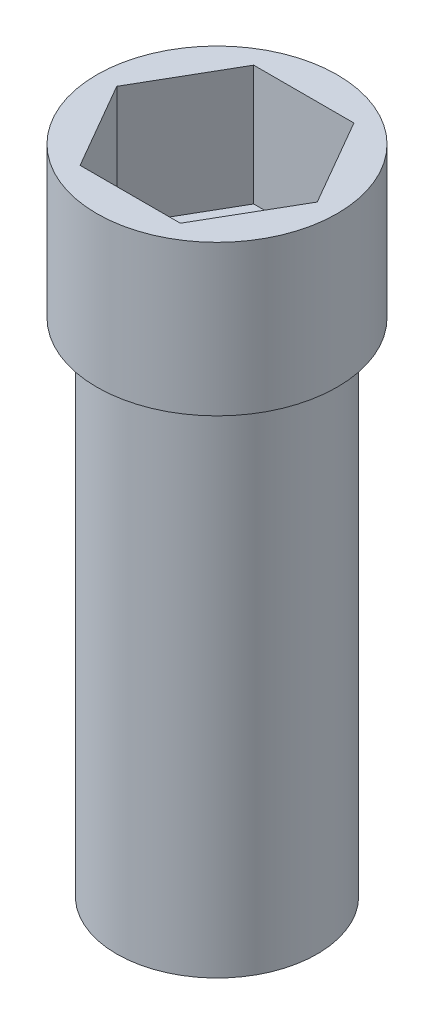
ISO-10303-21;
HEADER;
FILE_DESCRIPTION(('STEP AP214'),'2;1');
FILE_NAME('part.step','',(''),(''),'','','');
FILE_SCHEMA(('AUTOMOTIVE_DESIGN { 1 0 10303 214 1 1 1 1 }'));
ENDSEC;
DATA;
#1=APPLICATION_CONTEXT('core data for automotive mechanical design processes');
#2=APPLICATION_PROTOCOL_DEFINITION('international standard','automotive_design',2000,#1);
#3=PRODUCT_CONTEXT('',#1,'mechanical');
#4=PRODUCT('Part','Part','',(#3));
#5=PRODUCT_RELATED_PRODUCT_CATEGORY('part','',(#4));
#6=PRODUCT_DEFINITION_FORMATION('','',#4);
#7=PRODUCT_DEFINITION_CONTEXT('part definition',#1,'design');
#8=PRODUCT_DEFINITION('design','',#6,#7);
#9=PRODUCT_DEFINITION_SHAPE('','',#8);
#10=(LENGTH_UNIT() NAMED_UNIT(*) SI_UNIT(.MILLI.,.METRE.));
#11=(NAMED_UNIT(*) PLANE_ANGLE_UNIT() SI_UNIT($,.RADIAN.));
#12=(NAMED_UNIT(*) SI_UNIT($,.STERADIAN.) SOLID_ANGLE_UNIT());
#13=UNCERTAINTY_MEASURE_WITH_UNIT(LENGTH_MEASURE(1.E-05),#10,'distance_accuracy_value','');
#14=(GEOMETRIC_REPRESENTATION_CONTEXT(3) GLOBAL_UNCERTAINTY_ASSIGNED_CONTEXT((#13)) GLOBAL_UNIT_ASSIGNED_CONTEXT((#10,
#11,#12)) REPRESENTATION_CONTEXT('',''));
#15=CARTESIAN_POINT('',(0.,0.,0.));
#16=DIRECTION('',(0.,0.,1.));
#17=DIRECTION('',(1.,0.,0.));
#18=AXIS2_PLACEMENT_3D('',#15,#16,#17);
#19=CARTESIAN_POINT('',(0.,-1270.,0.));
#20=DIRECTION('',(0.,1.,0.));
#21=DIRECTION('',(0.,0.,1.));
#22=AXIS2_PLACEMENT_3D('',#19,#20,#21);
#23=CYLINDRICAL_SURFACE('',#22,254.);
#24=CARTESIAN_POINT('',(0.,-1270.,0.));
#25=DIRECTION('',(0.,1.,0.));
#26=DIRECTION('',(0.,0.,1.));
#27=AXIS2_PLACEMENT_3D('',#24,#25,#26);
#28=CIRCLE('',#27,254.);
#29=CARTESIAN_POINT('',(0.,-1270.,254.));
#30=VERTEX_POINT('',#29);
#31=EDGE_CURVE('E191',#30,#30,#28,.T.);
#32=ORIENTED_EDGE('',*,*,#31,.T.);
#33=EDGE_LOOP('',(#32));
#34=FACE_BOUND('',#33,.T.);
#35=CARTESIAN_POINT('',(0.,0.,0.));
#36=DIRECTION('',(0.,1.,0.));
#37=DIRECTION('',(0.,0.,1.));
#38=AXIS2_PLACEMENT_3D('',#35,#36,#37);
#39=CIRCLE('',#38,254.);
#40=CARTESIAN_POINT('',(0.,0.,254.));
#41=VERTEX_POINT('',#40);
#42=EDGE_CURVE('E188',#41,#41,#39,.T.);
#43=ORIENTED_EDGE('',*,*,#42,.F.);
#44=EDGE_LOOP('',(#43));
#45=FACE_BOUND('',#44,.T.);
#46=CARTESIAN_POINT('',(0.,-190.5,0.));
#47=DIRECTION('',(0.,-1.,0.));
#48=DIRECTION('',(0.,0.,-1.));
#49=AXIS2_PLACEMENT_3D('',#46,#47,#48);
#50=CIRCLE('',#49,254.);
#51=CARTESIAN_POINT('',(76.1999999999998,-190.5,-242.300557159905));
#52=VERTEX_POINT('',#51);
#53=CARTESIAN_POINT('',(-76.2,-190.5,-242.300557159918));
#54=VERTEX_POINT('',#53);
#55=EDGE_CURVE('E131',#52,#54,#50,.F.);
#56=ORIENTED_EDGE('',*,*,#55,.T.);
#57=DIRECTION('',(0.,1.,0.));
#58=VECTOR('',#57,1.);
#59=CARTESIAN_POINT('',(-76.1999999999998,-1269.99999999999,-242.300557159918));
#60=LINE('',#59,#58);
#61=CARTESIAN_POINT('',(-76.2,-825.499999999993,-242.300557159918));
#62=VERTEX_POINT('',#61);
#63=EDGE_CURVE('E11',#54,#62,#60,.F.);
#64=ORIENTED_EDGE('',*,*,#63,.T.);
#65=CARTESIAN_POINT('',(0.,-825.5,0.));
#66=DIRECTION('',(0.,1.,0.));
#67=DIRECTION('',(0.,0.,1.));
#68=AXIS2_PLACEMENT_3D('',#65,#66,#67);
#69=CIRCLE('',#68,254.);
#70=CARTESIAN_POINT('',(76.2,-825.5,-242.300557159904));
#71=VERTEX_POINT('',#70);
#72=EDGE_CURVE('E194',#62,#71,#69,.F.);
#73=ORIENTED_EDGE('',*,*,#72,.T.);
#74=DIRECTION('',(0.,1.,0.));
#75=VECTOR('',#74,1.);
#76=CARTESIAN_POINT('',(76.2,-1270.,-242.300557159904));
#77=LINE('',#76,#75);
#78=EDGE_CURVE('E44',#71,#52,#77,.T.);
#79=ORIENTED_EDGE('',*,*,#78,.T.);
#80=EDGE_LOOP('',(#56,#64,#73,#79));
#81=FACE_BOUND('',#80,.T.);
#82=ADVANCED_FACE('F37',(#34,#45,#81),#23,.T.);
#83=CARTESIAN_POINT('',(0.,-1270.,0.));
#84=DIRECTION('',(0.,1.,0.));
#85=DIRECTION('',(0.,0.,1.));
#86=AXIS2_PLACEMENT_3D('',#83,#84,#85);
#87=PLANE('',#86);
#88=ORIENTED_EDGE('',*,*,#31,.F.);
#89=EDGE_LOOP('',(#88));
#90=FACE_BOUND('',#89,.T.);
#91=ADVANCED_FACE('F219',(#90),#87,.F.);
#92=CARTESIAN_POINT('',(0.,381.,0.));
#93=DIRECTION('',(0.,-1.,0.));
#94=DIRECTION('',(0.,0.,-1.));
#95=AXIS2_PLACEMENT_3D('',#92,#93,#94);
#96=CYLINDRICAL_SURFACE('',#95,304.8);
#97=CARTESIAN_POINT('',(0.,381.,0.));
#98=DIRECTION('',(0.,1.,0.));
#99=DIRECTION('',(0.,0.,1.));
#100=AXIS2_PLACEMENT_3D('',#97,#98,#99);
#101=CIRCLE('',#100,304.8);
#102=CARTESIAN_POINT('',(0.,381.,304.8));
#103=VERTEX_POINT('',#102);
#104=EDGE_CURVE('E185',#103,#103,#101,.T.);
#105=ORIENTED_EDGE('',*,*,#104,.F.);
#106=EDGE_LOOP('',(#105));
#107=FACE_BOUND('',#106,.T.);
#108=CARTESIAN_POINT('',(0.,0.,0.));
#109=DIRECTION('',(0.,1.,0.));
#110=DIRECTION('',(0.,0.,1.));
#111=AXIS2_PLACEMENT_3D('',#108,#109,#110);
#112=CIRCLE('',#111,304.8);
#113=CARTESIAN_POINT('',(0.,0.,304.8));
#114=VERTEX_POINT('',#113);
#115=EDGE_CURVE('E175',#114,#114,#112,.T.);
#116=ORIENTED_EDGE('',*,*,#115,.T.);
#117=EDGE_LOOP('',(#116));
#118=FACE_BOUND('',#117,.T.);
#119=ADVANCED_FACE('F224',(#107,#118),#96,.T.);
#120=CARTESIAN_POINT('',(0.,381.,0.));
#121=DIRECTION('',(0.,1.,0.));
#122=DIRECTION('',(0.,0.,1.));
#123=AXIS2_PLACEMENT_3D('',#120,#121,#122);
#124=PLANE('',#123);
#125=DIRECTION('',(-0.500000000000001,0.,0.866025403784438));
#126=VECTOR('',#125,1.);
#127=CARTESIAN_POINT('',(-254.070753313979,381.,0.));
#128=LINE('',#127,#126);
#129=CARTESIAN_POINT('',(-127.035376656989,381.,-220.031726728555));
#130=VERTEX_POINT('',#129);
#131=CARTESIAN_POINT('',(-254.070753313979,381.,0.));
#132=VERTEX_POINT('',#131);
#133=EDGE_CURVE('E59',#130,#132,#128,.T.);
#134=ORIENTED_EDGE('',*,*,#133,.F.);
#135=DIRECTION('',(-1.,0.,0.));
#136=VECTOR('',#135,1.);
#137=CARTESIAN_POINT('',(-127.035376656989,381.,-220.031726728555));
#138=LINE('',#137,#136);
#139=CARTESIAN_POINT('',(127.03537665699,381.,-220.031726728555));
#140=VERTEX_POINT('',#139);
#141=EDGE_CURVE('E144',#140,#130,#138,.T.);
#142=ORIENTED_EDGE('',*,*,#141,.F.);
#143=DIRECTION('',(-0.500000000000001,0.,-0.866025403784438));
#144=VECTOR('',#143,1.);
#145=CARTESIAN_POINT('',(127.03537665699,381.,-220.031726728555));
#146=LINE('',#145,#144);
#147=CARTESIAN_POINT('',(254.07075331398,381.,0.));
#148=VERTEX_POINT('',#147);
#149=EDGE_CURVE('E168',#148,#140,#146,.T.);
#150=ORIENTED_EDGE('',*,*,#149,.F.);
#151=DIRECTION('',(0.500000000000001,0.,-0.866025403784438));
#152=VECTOR('',#151,1.);
#153=CARTESIAN_POINT('',(254.07075331398,381.,0.));
#154=LINE('',#153,#152);
#155=CARTESIAN_POINT('',(127.03537665699,381.,220.031726728555));
#156=VERTEX_POINT('',#155);
#157=EDGE_CURVE('E165',#156,#148,#154,.T.);
#158=ORIENTED_EDGE('',*,*,#157,.F.);
#159=DIRECTION('',(1.,0.,0.));
#160=VECTOR('',#159,1.);
#161=CARTESIAN_POINT('',(127.03537665699,381.,220.031726728555));
#162=LINE('',#161,#160);
#163=CARTESIAN_POINT('',(-127.035376656989,381.,220.031726728555));
#164=VERTEX_POINT('',#163);
#165=EDGE_CURVE('E162',#164,#156,#162,.T.);
#166=ORIENTED_EDGE('',*,*,#165,.F.);
#167=DIRECTION('',(0.500000000000001,0.,0.866025403784438));
#168=VECTOR('',#167,1.);
#169=CARTESIAN_POINT('',(-127.035376656989,381.,220.031726728555));
#170=LINE('',#169,#168);
#171=EDGE_CURVE('E134',#132,#164,#170,.T.);
#172=ORIENTED_EDGE('',*,*,#171,.F.);
#173=EDGE_LOOP('',(#134,#142,#150,#158,#166,#172));
#174=FACE_BOUND('',#173,.T.);
#175=ORIENTED_EDGE('',*,*,#104,.T.);
#176=EDGE_LOOP('',(#175));
#177=FACE_BOUND('',#176,.T.);
#178=ADVANCED_FACE('F234',(#174,#177),#124,.T.);
#179=CARTESIAN_POINT('',(0.,0.,0.));
#180=DIRECTION('',(0.,1.,0.));
#181=DIRECTION('',(0.,0.,1.));
#182=AXIS2_PLACEMENT_3D('',#179,#180,#181);
#183=PLANE('',#182);
#184=ORIENTED_EDGE('',*,*,#42,.T.);
#185=EDGE_LOOP('',(#184));
#186=FACE_BOUND('',#185,.T.);
#187=ORIENTED_EDGE('',*,*,#115,.F.);
#188=EDGE_LOOP('',(#187));
#189=FACE_BOUND('',#188,.T.);
#190=ADVANCED_FACE('F230',(#186,#189),#183,.F.);
#191=CARTESIAN_POINT('',(-254.070753313979,76.2,0.));
#192=DIRECTION('',(-0.866025403784438,0.,-0.500000000000001));
#193=DIRECTION('',(-0.500000000000001,0.,0.866025403784438));
#194=AXIS2_PLACEMENT_3D('',#191,#192,#193);
#195=PLANE('',#194);
#196=ORIENTED_EDGE('',*,*,#133,.T.);
#197=DIRECTION('',(0.,1.,0.));
#198=VECTOR('',#197,1.);
#199=CARTESIAN_POINT('',(-254.070753313979,76.2,0.));
#200=LINE('',#199,#198);
#201=CARTESIAN_POINT('',(-254.070753313979,76.2,0.));
#202=VERTEX_POINT('',#201);
#203=EDGE_CURVE('E158',#202,#132,#200,.T.);
#204=ORIENTED_EDGE('',*,*,#203,.F.);
#205=DIRECTION('',(-0.500000000000001,0.,0.866025403784438));
#206=VECTOR('',#205,1.);
#207=CARTESIAN_POINT('',(-254.070753313979,76.2,0.));
#208=LINE('',#207,#206);
#209=CARTESIAN_POINT('',(-127.035376656989,76.2,-220.031726728555));
#210=VERTEX_POINT('',#209);
#211=EDGE_CURVE('E140',#210,#202,#208,.T.);
#212=ORIENTED_EDGE('',*,*,#211,.F.);
#213=DIRECTION('',(0.,1.,0.));
#214=VECTOR('',#213,1.);
#215=CARTESIAN_POINT('',(-127.035376656989,76.2,-220.031726728555));
#216=LINE('',#215,#214);
#217=EDGE_CURVE('E173',#210,#130,#216,.T.);
#218=ORIENTED_EDGE('',*,*,#217,.T.);
#219=EDGE_LOOP('',(#196,#204,#212,#218));
#220=FACE_BOUND('',#219,.T.);
#221=ADVANCED_FACE('F233',(#220),#195,.F.);
#222=CARTESIAN_POINT('',(-127.035376656989,76.2,-220.031726728555));
#223=DIRECTION('',(0.,0.,-1.));
#224=DIRECTION('',(-1.,0.,0.));
#225=AXIS2_PLACEMENT_3D('',#222,#223,#224);
#226=PLANE('',#225);
#227=ORIENTED_EDGE('',*,*,#141,.T.);
#228=ORIENTED_EDGE('',*,*,#217,.F.);
#229=DIRECTION('',(-1.,0.,0.));
#230=VECTOR('',#229,1.);
#231=CARTESIAN_POINT('',(-127.035376656989,76.2,-220.031726728555));
#232=LINE('',#231,#230);
#233=CARTESIAN_POINT('',(127.03537665699,76.2000000000017,-220.031726728555));
#234=VERTEX_POINT('',#233);
#235=EDGE_CURVE('E156',#234,#210,#232,.T.);
#236=ORIENTED_EDGE('',*,*,#235,.F.);
#237=DIRECTION('',(0.,1.,0.));
#238=VECTOR('',#237,1.);
#239=CARTESIAN_POINT('',(127.03537665699,76.2000000000017,-220.031726728555));
#240=LINE('',#239,#238);
#241=EDGE_CURVE('E176',#234,#140,#240,.T.);
#242=ORIENTED_EDGE('',*,*,#241,.T.);
#243=EDGE_LOOP('',(#227,#228,#236,#242));
#244=FACE_BOUND('',#243,.T.);
#245=ADVANCED_FACE('F250',(#244),#226,.F.);
#246=CARTESIAN_POINT('',(127.03537665699,76.2000000000017,-220.031726728555));
#247=DIRECTION('',(0.866025403784438,0.,-0.500000000000001));
#248=DIRECTION('',(-0.500000000000001,0.,-0.866025403784438));
#249=AXIS2_PLACEMENT_3D('',#246,#247,#248);
#250=PLANE('',#249);
#251=ORIENTED_EDGE('',*,*,#149,.T.);
#252=ORIENTED_EDGE('',*,*,#241,.F.);
#253=DIRECTION('',(-0.500000000000001,0.,-0.866025403784438));
#254=VECTOR('',#253,1.);
#255=CARTESIAN_POINT('',(127.03537665699,76.2000000000017,-220.031726728555));
#256=LINE('',#255,#254);
#257=CARTESIAN_POINT('',(254.070753313979,76.2000000000017,0.));
#258=VERTEX_POINT('',#257);
#259=EDGE_CURVE('E153',#258,#234,#256,.T.);
#260=ORIENTED_EDGE('',*,*,#259,.F.);
#261=DIRECTION('',(0.,1.,0.));
#262=VECTOR('',#261,1.);
#263=CARTESIAN_POINT('',(254.070753313979,76.2000000000017,0.));
#264=LINE('',#263,#262);
#265=EDGE_CURVE('E178',#258,#148,#264,.T.);
#266=ORIENTED_EDGE('',*,*,#265,.T.);
#267=EDGE_LOOP('',(#251,#252,#260,#266));
#268=FACE_BOUND('',#267,.T.);
#269=ADVANCED_FACE('F263',(#268),#250,.F.);
#270=CARTESIAN_POINT('',(254.070753313979,76.2000000000017,0.));
#271=DIRECTION('',(0.866025403784438,0.,0.500000000000001));
#272=DIRECTION('',(0.500000000000001,0.,-0.866025403784438));
#273=AXIS2_PLACEMENT_3D('',#270,#271,#272);
#274=PLANE('',#273);
#275=ORIENTED_EDGE('',*,*,#157,.T.);
#276=ORIENTED_EDGE('',*,*,#265,.F.);
#277=DIRECTION('',(0.500000000000001,0.,-0.866025403784438));
#278=VECTOR('',#277,1.);
#279=CARTESIAN_POINT('',(254.070753313979,76.2000000000017,0.));
#280=LINE('',#279,#278);
#281=CARTESIAN_POINT('',(127.03537665699,76.2000000000017,220.031726728555));
#282=VERTEX_POINT('',#281);
#283=EDGE_CURVE('E150',#282,#258,#280,.T.);
#284=ORIENTED_EDGE('',*,*,#283,.F.);
#285=DIRECTION('',(0.,1.,0.));
#286=VECTOR('',#285,1.);
#287=CARTESIAN_POINT('',(127.03537665699,76.2000000000017,220.031726728555));
#288=LINE('',#287,#286);
#289=EDGE_CURVE('E180',#282,#156,#288,.T.);
#290=ORIENTED_EDGE('',*,*,#289,.T.);
#291=EDGE_LOOP('',(#275,#276,#284,#290));
#292=FACE_BOUND('',#291,.T.);
#293=ADVANCED_FACE('F259',(#292),#274,.F.);
#294=CARTESIAN_POINT('',(127.03537665699,76.2000000000017,220.031726728555));
#295=DIRECTION('',(0.,0.,1.));
#296=DIRECTION('',(1.,0.,0.));
#297=AXIS2_PLACEMENT_3D('',#294,#295,#296);
#298=PLANE('',#297);
#299=ORIENTED_EDGE('',*,*,#165,.T.);
#300=ORIENTED_EDGE('',*,*,#289,.F.);
#301=DIRECTION('',(1.,0.,0.));
#302=VECTOR('',#301,1.);
#303=CARTESIAN_POINT('',(127.03537665699,76.2000000000017,220.031726728555));
#304=LINE('',#303,#302);
#305=CARTESIAN_POINT('',(-127.035376656989,76.2,220.031726728555));
#306=VERTEX_POINT('',#305);
#307=EDGE_CURVE('E147',#306,#282,#304,.T.);
#308=ORIENTED_EDGE('',*,*,#307,.F.);
#309=DIRECTION('',(0.,1.,0.));
#310=VECTOR('',#309,1.);
#311=CARTESIAN_POINT('',(-127.035376656989,76.2,220.031726728555));
#312=LINE('',#311,#310);
#313=EDGE_CURVE('E182',#306,#164,#312,.T.);
#314=ORIENTED_EDGE('',*,*,#313,.T.);
#315=EDGE_LOOP('',(#299,#300,#308,#314));
#316=FACE_BOUND('',#315,.T.);
#317=ADVANCED_FACE('F255',(#316),#298,.F.);
#318=CARTESIAN_POINT('',(-127.035376656989,76.2,220.031726728555));
#319=DIRECTION('',(-0.866025403784438,0.,0.500000000000001));
#320=DIRECTION('',(0.500000000000001,0.,0.866025403784438));
#321=AXIS2_PLACEMENT_3D('',#318,#319,#320);
#322=PLANE('',#321);
#323=ORIENTED_EDGE('',*,*,#171,.T.);
#324=ORIENTED_EDGE('',*,*,#313,.F.);
#325=DIRECTION('',(0.500000000000001,0.,0.866025403784438));
#326=VECTOR('',#325,1.);
#327=CARTESIAN_POINT('',(-127.035376656989,76.2,220.031726728555));
#328=LINE('',#327,#326);
#329=EDGE_CURVE('E143',#202,#306,#328,.T.);
#330=ORIENTED_EDGE('',*,*,#329,.F.);
#331=ORIENTED_EDGE('',*,*,#203,.T.);
#332=EDGE_LOOP('',(#323,#324,#330,#331));
#333=FACE_BOUND('',#332,.T.);
#334=ADVANCED_FACE('F251',(#333),#322,.F.);
#335=CARTESIAN_POINT('',(0.,76.2,0.));
#336=DIRECTION('',(0.,-1.,0.));
#337=DIRECTION('',(0.,0.,-1.));
#338=AXIS2_PLACEMENT_3D('',#335,#336,#337);
#339=PLANE('',#338);
#340=ORIENTED_EDGE('',*,*,#211,.T.);
#341=ORIENTED_EDGE('',*,*,#329,.T.);
#342=ORIENTED_EDGE('',*,*,#307,.T.);
#343=ORIENTED_EDGE('',*,*,#283,.T.);
#344=ORIENTED_EDGE('',*,*,#259,.T.);
#345=ORIENTED_EDGE('',*,*,#235,.T.);
#346=EDGE_LOOP('',(#340,#341,#342,#343,#344,#345));
#347=FACE_BOUND('',#346,.T.);
#348=ADVANCED_FACE('F254',(#347),#339,.F.);
#349=CARTESIAN_POINT('',(76.2,-825.5,-152.4));
#350=DIRECTION('',(-1.,0.,0.));
#351=DIRECTION('',(0.,-1.,0.));
#352=AXIS2_PLACEMENT_3D('',#349,#350,#351);
#353=PLANE('',#352);
#354=DIRECTION('',(0.,0.,-1.));
#355=VECTOR('',#354,1.);
#356=CARTESIAN_POINT('',(76.2,-825.5,-152.4));
#357=LINE('',#356,#355);
#358=CARTESIAN_POINT('',(76.2,-825.5,-152.4));
#359=VERTEX_POINT('',#358);
#360=EDGE_CURVE('E51',#359,#71,#357,.T.);
#361=ORIENTED_EDGE('',*,*,#360,.F.);
#362=DIRECTION('',(0.,1.,0.));
#363=VECTOR('',#362,1.);
#364=CARTESIAN_POINT('',(76.2,-825.5,-152.4));
#365=LINE('',#364,#363);
#366=CARTESIAN_POINT('',(76.2,-190.5,-152.4));
#367=VERTEX_POINT('',#366);
#368=EDGE_CURVE('E117',#359,#367,#365,.T.);
#369=ORIENTED_EDGE('',*,*,#368,.T.);
#370=DIRECTION('',(0.,0.,-1.));
#371=VECTOR('',#370,1.);
#372=CARTESIAN_POINT('',(76.2,-190.5,-152.4));
#373=LINE('',#372,#371);
#374=EDGE_CURVE('E127',#367,#52,#373,.T.);
#375=ORIENTED_EDGE('',*,*,#374,.T.);
#376=ORIENTED_EDGE('',*,*,#78,.F.);
#377=EDGE_LOOP('',(#361,#369,#375,#376));
#378=FACE_BOUND('',#377,.T.);
#379=ADVANCED_FACE('F126',(#378),#353,.T.);
#380=CARTESIAN_POINT('',(-76.2,-190.5,-152.400000000013));
#381=DIRECTION('',(0.,-1.,0.));
#382=DIRECTION('',(0.,0.,-1.));
#383=AXIS2_PLACEMENT_3D('',#380,#381,#382);
#384=PLANE('',#383);
#385=ORIENTED_EDGE('',*,*,#55,.F.);
#386=ORIENTED_EDGE('',*,*,#374,.F.);
#387=DIRECTION('',(-1.,0.,0.));
#388=VECTOR('',#387,1.);
#389=CARTESIAN_POINT('',(-76.2,-190.5,-152.400000000013));
#390=LINE('',#389,#388);
#391=CARTESIAN_POINT('',(-76.2,-190.5,-152.400000000013));
#392=VERTEX_POINT('',#391);
#393=EDGE_CURVE('E113',#367,#392,#390,.T.);
#394=ORIENTED_EDGE('',*,*,#393,.T.);
#395=DIRECTION('',(0.,0.,-1.));
#396=VECTOR('',#395,1.);
#397=CARTESIAN_POINT('',(-76.2,-190.5,-152.400000000013));
#398=LINE('',#397,#396);
#399=EDGE_CURVE('E132',#392,#54,#398,.T.);
#400=ORIENTED_EDGE('',*,*,#399,.T.);
#401=EDGE_LOOP('',(#385,#386,#394,#400));
#402=FACE_BOUND('',#401,.T.);
#403=ADVANCED_FACE('F130',(#402),#384,.T.);
#404=CARTESIAN_POINT('',(-76.1999999999998,-825.499999999993,-152.400000000013));
#405=DIRECTION('',(1.,0.,0.));
#406=DIRECTION('',(0.,1.,0.));
#407=AXIS2_PLACEMENT_3D('',#404,#405,#406);
#408=PLANE('',#407);
#409=ORIENTED_EDGE('',*,*,#399,.F.);
#410=DIRECTION('',(0.,-1.,0.));
#411=VECTOR('',#410,1.);
#412=CARTESIAN_POINT('',(-76.1999999999998,-825.499999999993,-152.400000000013));
#413=LINE('',#412,#411);
#414=CARTESIAN_POINT('',(-76.1999999999998,-825.499999999993,-152.400000000013));
#415=VERTEX_POINT('',#414);
#416=EDGE_CURVE('E118',#392,#415,#413,.T.);
#417=ORIENTED_EDGE('',*,*,#416,.T.);
#418=DIRECTION('',(0.,0.,-1.));
#419=VECTOR('',#418,1.);
#420=CARTESIAN_POINT('',(-76.1999999999998,-825.499999999993,-152.400000000013));
#421=LINE('',#420,#419);
#422=EDGE_CURVE('E136',#415,#62,#421,.T.);
#423=ORIENTED_EDGE('',*,*,#422,.T.);
#424=ORIENTED_EDGE('',*,*,#63,.F.);
#425=EDGE_LOOP('',(#409,#417,#423,#424));
#426=FACE_BOUND('',#425,.T.);
#427=ADVANCED_FACE('F205',(#426),#408,.T.);
#428=CARTESIAN_POINT('',(-76.1999999999998,-825.499999999993,-152.400000000013));
#429=DIRECTION('',(0.,1.,0.));
#430=DIRECTION('',(0.,0.,1.));
#431=AXIS2_PLACEMENT_3D('',#428,#429,#430);
#432=PLANE('',#431);
#433=ORIENTED_EDGE('',*,*,#422,.F.);
#434=DIRECTION('',(1.,0.,0.));
#435=VECTOR('',#434,1.);
#436=CARTESIAN_POINT('',(-76.1999999999998,-825.499999999993,-152.400000000013));
#437=LINE('',#436,#435);
#438=EDGE_CURVE('E206',#415,#359,#437,.T.);
#439=ORIENTED_EDGE('',*,*,#438,.T.);
#440=ORIENTED_EDGE('',*,*,#360,.T.);
#441=ORIENTED_EDGE('',*,*,#72,.F.);
#442=EDGE_LOOP('',(#433,#439,#440,#441));
#443=FACE_BOUND('',#442,.T.);
#444=ADVANCED_FACE('F203',(#443),#432,.T.);
#445=CARTESIAN_POINT('',(0.,0.,-152.4));
#446=DIRECTION('',(0.,0.,-1.));
#447=DIRECTION('',(-1.,0.,0.));
#448=AXIS2_PLACEMENT_3D('',#445,#446,#447);
#449=PLANE('',#448);
#450=ORIENTED_EDGE('',*,*,#368,.F.);
#451=ORIENTED_EDGE('',*,*,#438,.F.);
#452=ORIENTED_EDGE('',*,*,#416,.F.);
#453=ORIENTED_EDGE('',*,*,#393,.F.);
#454=EDGE_LOOP('',(#450,#451,#452,#453));
#455=FACE_BOUND('',#454,.T.);
#456=ADVANCED_FACE('F115',(#455),#449,.T.);
#457=CLOSED_SHELL('',(#82,#91,#119,#178,#190,#221,#245,#269,#293,#317,#334,#348,#379,#403,#427,
#444,#456));
#458=MANIFOLD_SOLID_BREP('B2',#457);
#459=ADVANCED_BREP_SHAPE_REPRESENTATION('',(#18,#458),#14);
#460=SHAPE_DEFINITION_REPRESENTATION(#9,#459);
ENDSEC;
END-ISO-10303-21;
